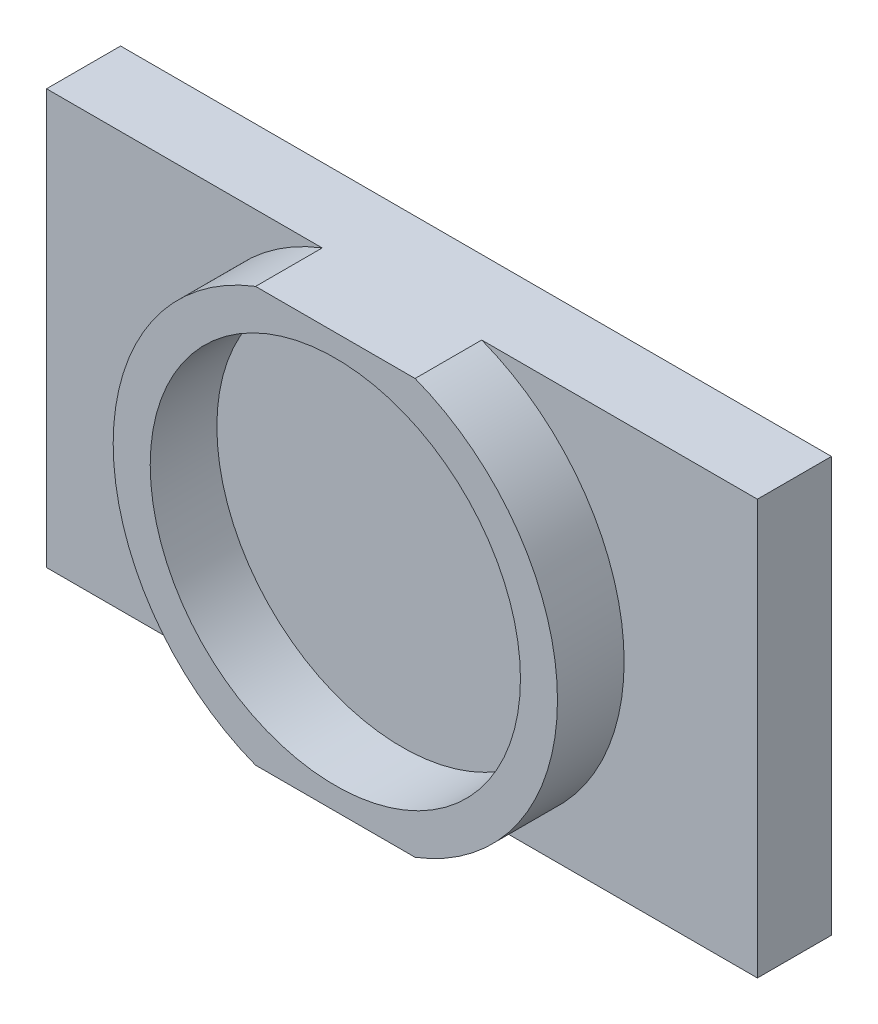
ISO-10303-21;
HEADER;
FILE_DESCRIPTION(('STEP AP214'),'2;1');
FILE_NAME('part.step','',(''),(''),'','','');
FILE_SCHEMA(('AUTOMOTIVE_DESIGN { 1 0 10303 214 1 1 1 1 }'));
ENDSEC;
DATA;
#1=APPLICATION_CONTEXT('core data for automotive mechanical design processes');
#2=APPLICATION_PROTOCOL_DEFINITION('international standard','automotive_design',2000,#1);
#3=PRODUCT_CONTEXT('',#1,'mechanical');
#4=PRODUCT('Part','Part','',(#3));
#5=PRODUCT_RELATED_PRODUCT_CATEGORY('part','',(#4));
#6=PRODUCT_DEFINITION_FORMATION('','',#4);
#7=PRODUCT_DEFINITION_CONTEXT('part definition',#1,'design');
#8=PRODUCT_DEFINITION('design','',#6,#7);
#9=PRODUCT_DEFINITION_SHAPE('','',#8);
#10=(LENGTH_UNIT() NAMED_UNIT(*) SI_UNIT(.MILLI.,.METRE.));
#11=(NAMED_UNIT(*) PLANE_ANGLE_UNIT() SI_UNIT($,.RADIAN.));
#12=(NAMED_UNIT(*) SI_UNIT($,.STERADIAN.) SOLID_ANGLE_UNIT());
#13=UNCERTAINTY_MEASURE_WITH_UNIT(LENGTH_MEASURE(1.E-05),#10,'distance_accuracy_value','');
#14=(GEOMETRIC_REPRESENTATION_CONTEXT(3) GLOBAL_UNCERTAINTY_ASSIGNED_CONTEXT((#13)) GLOBAL_UNIT_ASSIGNED_CONTEXT((#10,
#11,#12)) REPRESENTATION_CONTEXT('',''));
#15=CARTESIAN_POINT('',(0.,0.,0.));
#16=DIRECTION('',(0.,0.,1.));
#17=DIRECTION('',(1.,0.,0.));
#18=AXIS2_PLACEMENT_3D('',#15,#16,#17);
#19=CARTESIAN_POINT('',(0.,0.,0.));
#20=DIRECTION('',(0.,0.,1.));
#21=DIRECTION('',(1.,0.,0.));
#22=AXIS2_PLACEMENT_3D('',#19,#20,#21);
#23=PLANE('',#22);
#24=CARTESIAN_POINT('',(0.,0.,0.));
#25=DIRECTION('',(0.,0.,1.));
#26=DIRECTION('',(1.,0.,0.));
#27=AXIS2_PLACEMENT_3D('',#24,#25,#26);
#28=CIRCLE('',#27,38.1);
#29=CARTESIAN_POINT('',(-13.6783186101217,35.56,0.));
#30=VERTEX_POINT('',#29);
#31=CARTESIAN_POINT('',(-13.6783186101217,-35.56,0.));
#32=VERTEX_POINT('',#31);
#33=EDGE_CURVE('E50',#30,#32,#28,.T.);
#34=ORIENTED_EDGE('',*,*,#33,.F.);
#35=DIRECTION('',(-1.,0.,0.));
#36=VECTOR('',#35,1.);
#37=CARTESIAN_POINT('',(-60.96,35.56,0.));
#38=LINE('',#37,#36);
#39=CARTESIAN_POINT('',(-60.96,35.56,0.));
#40=VERTEX_POINT('',#39);
#41=EDGE_CURVE('E146',#30,#40,#38,.T.);
#42=ORIENTED_EDGE('',*,*,#41,.T.);
#43=DIRECTION('',(0.,-1.,0.));
#44=VECTOR('',#43,1.);
#45=CARTESIAN_POINT('',(-60.96,-35.56,0.));
#46=LINE('',#45,#44);
#47=CARTESIAN_POINT('',(-60.96,-35.56,0.));
#48=VERTEX_POINT('',#47);
#49=EDGE_CURVE('E215',#40,#48,#46,.T.);
#50=ORIENTED_EDGE('',*,*,#49,.T.);
#51=DIRECTION('',(1.,0.,0.));
#52=VECTOR('',#51,1.);
#53=CARTESIAN_POINT('',(-60.96,-35.56,0.));
#54=LINE('',#53,#52);
#55=EDGE_CURVE('E123',#48,#32,#54,.T.);
#56=ORIENTED_EDGE('',*,*,#55,.T.);
#57=EDGE_LOOP('',(#34,#42,#50,#56));
#58=FACE_BOUND('',#57,.T.);
#59=ADVANCED_FACE('F33',(#58),#23,.T.);
#60=CARTESIAN_POINT('',(-60.96,-35.56,-12.7));
#61=DIRECTION('',(0.,-1.,0.));
#62=DIRECTION('',(0.,0.,-1.));
#63=AXIS2_PLACEMENT_3D('',#60,#61,#62);
#64=PLANE('',#63);
#65=ORIENTED_EDGE('',*,*,#55,.F.);
#66=DIRECTION('',(0.,0.,1.));
#67=VECTOR('',#66,1.);
#68=CARTESIAN_POINT('',(-60.96,-35.56,-12.7));
#69=LINE('',#68,#67);
#70=CARTESIAN_POINT('',(-60.96,-35.56,-12.7));
#71=VERTEX_POINT('',#70);
#72=EDGE_CURVE('E11',#71,#48,#69,.T.);
#73=ORIENTED_EDGE('',*,*,#72,.F.);
#74=DIRECTION('',(1.,0.,0.));
#75=VECTOR('',#74,1.);
#76=CARTESIAN_POINT('',(-60.96,-35.56,-12.7));
#77=LINE('',#76,#75);
#78=CARTESIAN_POINT('',(60.96,-35.56,-12.7));
#79=VERTEX_POINT('',#78);
#80=EDGE_CURVE('E141',#71,#79,#77,.T.);
#81=ORIENTED_EDGE('',*,*,#80,.T.);
#82=DIRECTION('',(0.,0.,1.));
#83=VECTOR('',#82,1.);
#84=CARTESIAN_POINT('',(60.96,-35.56,-12.7));
#85=LINE('',#84,#83);
#86=CARTESIAN_POINT('',(60.96,-35.56,0.));
#87=VERTEX_POINT('',#86);
#88=EDGE_CURVE('E220',#79,#87,#85,.T.);
#89=ORIENTED_EDGE('',*,*,#88,.T.);
#90=CARTESIAN_POINT('',(13.6783186101217,-35.56,0.));
#91=VERTEX_POINT('',#90);
#92=EDGE_CURVE('E121',#91,#87,#54,.T.);
#93=ORIENTED_EDGE('',*,*,#92,.F.);
#94=DIRECTION('',(0.,0.,-1.));
#95=VECTOR('',#94,1.);
#96=CARTESIAN_POINT('',(13.6783186101217,-35.56,11.43));
#97=LINE('',#96,#95);
#98=CARTESIAN_POINT('',(13.6783186101217,-35.56,11.43));
#99=VERTEX_POINT('',#98);
#100=EDGE_CURVE('E105',#99,#91,#97,.T.);
#101=ORIENTED_EDGE('',*,*,#100,.F.);
#102=DIRECTION('',(1.,0.,0.));
#103=VECTOR('',#102,1.);
#104=CARTESIAN_POINT('',(-13.6783186101217,-35.56,11.43));
#105=LINE('',#104,#103);
#106=CARTESIAN_POINT('',(-13.6783186101217,-35.56,11.43));
#107=VERTEX_POINT('',#106);
#108=EDGE_CURVE('E99',#107,#99,#105,.T.);
#109=ORIENTED_EDGE('',*,*,#108,.F.);
#110=DIRECTION('',(0.,0.,-1.));
#111=VECTOR('',#110,1.);
#112=CARTESIAN_POINT('',(-13.6783186101217,-35.56,11.43));
#113=LINE('',#112,#111);
#114=EDGE_CURVE('E103',#107,#32,#113,.T.);
#115=ORIENTED_EDGE('',*,*,#114,.T.);
#116=EDGE_LOOP('',(#65,#73,#81,#89,#93,#101,#109,#115));
#117=FACE_BOUND('',#116,.T.);
#118=ADVANCED_FACE('F35',(#117),#64,.T.);
#119=CARTESIAN_POINT('',(-60.96,-35.56,-12.7));
#120=DIRECTION('',(-1.,0.,0.));
#121=DIRECTION('',(0.,0.,1.));
#122=AXIS2_PLACEMENT_3D('',#119,#120,#121);
#123=PLANE('',#122);
#124=ORIENTED_EDGE('',*,*,#49,.F.);
#125=DIRECTION('',(0.,0.,1.));
#126=VECTOR('',#125,1.);
#127=CARTESIAN_POINT('',(-60.96,35.56,-12.7));
#128=LINE('',#127,#126);
#129=CARTESIAN_POINT('',(-60.96,35.56,-12.7));
#130=VERTEX_POINT('',#129);
#131=EDGE_CURVE('E42',#130,#40,#128,.T.);
#132=ORIENTED_EDGE('',*,*,#131,.F.);
#133=DIRECTION('',(0.,-1.,0.));
#134=VECTOR('',#133,1.);
#135=CARTESIAN_POINT('',(-60.96,-35.56,-12.7));
#136=LINE('',#135,#134);
#137=EDGE_CURVE('E211',#130,#71,#136,.T.);
#138=ORIENTED_EDGE('',*,*,#137,.T.);
#139=ORIENTED_EDGE('',*,*,#72,.T.);
#140=EDGE_LOOP('',(#124,#132,#138,#139));
#141=FACE_BOUND('',#140,.T.);
#142=ADVANCED_FACE('F182',(#141),#123,.T.);
#143=CARTESIAN_POINT('',(-60.96,35.56,-12.7));
#144=DIRECTION('',(0.,1.,0.));
#145=DIRECTION('',(0.,0.,1.));
#146=AXIS2_PLACEMENT_3D('',#143,#144,#145);
#147=PLANE('',#146);
#148=CARTESIAN_POINT('',(60.96,35.56,0.));
#149=VERTEX_POINT('',#148);
#150=CARTESIAN_POINT('',(13.6783186101217,35.56,0.));
#151=VERTEX_POINT('',#150);
#152=EDGE_CURVE('E236',#149,#151,#38,.T.);
#153=ORIENTED_EDGE('',*,*,#152,.F.);
#154=DIRECTION('',(0.,0.,1.));
#155=VECTOR('',#154,1.);
#156=CARTESIAN_POINT('',(60.96,35.56,-12.7));
#157=LINE('',#156,#155);
#158=CARTESIAN_POINT('',(60.96,35.56,-12.7));
#159=VERTEX_POINT('',#158);
#160=EDGE_CURVE('E223',#159,#149,#157,.T.);
#161=ORIENTED_EDGE('',*,*,#160,.F.);
#162=DIRECTION('',(-1.,0.,0.));
#163=VECTOR('',#162,1.);
#164=CARTESIAN_POINT('',(-60.96,35.56,-12.7));
#165=LINE('',#164,#163);
#166=EDGE_CURVE('E221',#159,#130,#165,.T.);
#167=ORIENTED_EDGE('',*,*,#166,.T.);
#168=ORIENTED_EDGE('',*,*,#131,.T.);
#169=ORIENTED_EDGE('',*,*,#41,.F.);
#170=DIRECTION('',(0.,0.,-1.));
#171=VECTOR('',#170,1.);
#172=CARTESIAN_POINT('',(-13.6783186101216,35.56,11.43));
#173=LINE('',#172,#171);
#174=CARTESIAN_POINT('',(-13.6783186101216,35.56,11.43));
#175=VERTEX_POINT('',#174);
#176=EDGE_CURVE('E134',#175,#30,#173,.T.);
#177=ORIENTED_EDGE('',*,*,#176,.F.);
#178=DIRECTION('',(-1.,0.,0.));
#179=VECTOR('',#178,1.);
#180=CARTESIAN_POINT('',(-13.6783186101216,35.56,11.43));
#181=LINE('',#180,#179);
#182=CARTESIAN_POINT('',(13.6783186101217,35.56,11.43));
#183=VERTEX_POINT('',#182);
#184=EDGE_CURVE('E115',#183,#175,#181,.T.);
#185=ORIENTED_EDGE('',*,*,#184,.F.);
#186=DIRECTION('',(0.,0.,-1.));
#187=VECTOR('',#186,1.);
#188=CARTESIAN_POINT('',(13.6783186101217,35.56,11.43));
#189=LINE('',#188,#187);
#190=EDGE_CURVE('E125',#183,#151,#189,.T.);
#191=ORIENTED_EDGE('',*,*,#190,.T.);
#192=EDGE_LOOP('',(#153,#161,#167,#168,#169,#177,#185,#191));
#193=FACE_BOUND('',#192,.T.);
#194=ADVANCED_FACE('F203',(#193),#147,.T.);
#195=CARTESIAN_POINT('',(60.96,-35.56,-12.7));
#196=DIRECTION('',(1.,0.,0.));
#197=DIRECTION('',(0.,0.,-1.));
#198=AXIS2_PLACEMENT_3D('',#195,#196,#197);
#199=PLANE('',#198);
#200=DIRECTION('',(0.,1.,0.));
#201=VECTOR('',#200,1.);
#202=CARTESIAN_POINT('',(60.96,-35.56,0.));
#203=LINE('',#202,#201);
#204=EDGE_CURVE('E229',#87,#149,#203,.T.);
#205=ORIENTED_EDGE('',*,*,#204,.F.);
#206=ORIENTED_EDGE('',*,*,#88,.F.);
#207=DIRECTION('',(0.,1.,0.));
#208=VECTOR('',#207,1.);
#209=CARTESIAN_POINT('',(60.96,-35.56,-12.7));
#210=LINE('',#209,#208);
#211=EDGE_CURVE('E213',#79,#159,#210,.T.);
#212=ORIENTED_EDGE('',*,*,#211,.T.);
#213=ORIENTED_EDGE('',*,*,#160,.T.);
#214=EDGE_LOOP('',(#205,#206,#212,#213));
#215=FACE_BOUND('',#214,.T.);
#216=ADVANCED_FACE('F198',(#215),#199,.T.);
#217=CARTESIAN_POINT('',(0.,0.,-12.7));
#218=DIRECTION('',(0.,0.,1.));
#219=DIRECTION('',(1.,0.,0.));
#220=AXIS2_PLACEMENT_3D('',#217,#218,#219);
#221=PLANE('',#220);
#222=ORIENTED_EDGE('',*,*,#80,.F.);
#223=ORIENTED_EDGE('',*,*,#137,.F.);
#224=ORIENTED_EDGE('',*,*,#166,.F.);
#225=ORIENTED_EDGE('',*,*,#211,.F.);
#226=EDGE_LOOP('',(#222,#223,#224,#225));
#227=FACE_BOUND('',#226,.T.);
#228=ADVANCED_FACE('F173',(#227),#221,.F.);
#229=CARTESIAN_POINT('',(0.,0.,0.));
#230=DIRECTION('',(0.,0.,1.));
#231=DIRECTION('',(1.,0.,0.));
#232=AXIS2_PLACEMENT_3D('',#229,#230,#231);
#233=CIRCLE('',#232,38.1);
#234=EDGE_CURVE('E58',#91,#151,#233,.T.);
#235=ORIENTED_EDGE('',*,*,#234,.F.);
#236=ORIENTED_EDGE('',*,*,#92,.T.);
#237=ORIENTED_EDGE('',*,*,#204,.T.);
#238=ORIENTED_EDGE('',*,*,#152,.T.);
#239=EDGE_LOOP('',(#235,#236,#237,#238));
#240=FACE_BOUND('',#239,.T.);
#241=ADVANCED_FACE('F165',(#240),#23,.T.);
#242=CARTESIAN_POINT('',(0.,0.,11.43));
#243=DIRECTION('',(0.,0.,1.));
#244=DIRECTION('',(1.,0.,0.));
#245=AXIS2_PLACEMENT_3D('',#242,#243,#244);
#246=PLANE('',#245);
#247=CARTESIAN_POINT('',(0.,0.,11.43));
#248=DIRECTION('',(0.,0.,1.));
#249=DIRECTION('',(1.,0.,0.));
#250=AXIS2_PLACEMENT_3D('',#247,#248,#249);
#251=CIRCLE('',#250,38.1);
#252=EDGE_CURVE('E109',#175,#107,#251,.T.);
#253=ORIENTED_EDGE('',*,*,#252,.T.);
#254=ORIENTED_EDGE('',*,*,#108,.T.);
#255=CARTESIAN_POINT('',(0.,0.,11.43));
#256=DIRECTION('',(0.,0.,1.));
#257=DIRECTION('',(1.,0.,0.));
#258=AXIS2_PLACEMENT_3D('',#255,#256,#257);
#259=CIRCLE('',#258,38.1);
#260=EDGE_CURVE('E108',#99,#183,#259,.T.);
#261=ORIENTED_EDGE('',*,*,#260,.T.);
#262=ORIENTED_EDGE('',*,*,#184,.T.);
#263=EDGE_LOOP('',(#253,#254,#261,#262));
#264=FACE_BOUND('',#263,.T.);
#265=CARTESIAN_POINT('',(0.,0.,11.43));
#266=DIRECTION('',(0.,0.,1.));
#267=DIRECTION('',(1.,0.,0.));
#268=AXIS2_PLACEMENT_3D('',#265,#266,#267);
#269=CIRCLE('',#268,31.75);
#270=CARTESIAN_POINT('',(31.75,0.,11.43));
#271=VERTEX_POINT('',#270);
#272=EDGE_CURVE('E133',#271,#271,#269,.T.);
#273=ORIENTED_EDGE('',*,*,#272,.F.);
#274=EDGE_LOOP('',(#273));
#275=FACE_BOUND('',#274,.T.);
#276=ADVANCED_FACE('F112',(#264,#275),#246,.T.);
#277=CARTESIAN_POINT('',(0.,0.,11.43));
#278=DIRECTION('',(0.,0.,-1.));
#279=DIRECTION('',(-1.,0.,0.));
#280=AXIS2_PLACEMENT_3D('',#277,#278,#279);
#281=CYLINDRICAL_SURFACE('',#280,38.1);
#282=ORIENTED_EDGE('',*,*,#33,.T.);
#283=ORIENTED_EDGE('',*,*,#114,.F.);
#284=ORIENTED_EDGE('',*,*,#252,.F.);
#285=ORIENTED_EDGE('',*,*,#176,.T.);
#286=EDGE_LOOP('',(#282,#283,#284,#285));
#287=FACE_BOUND('',#286,.T.);
#288=ADVANCED_FACE('F120',(#287),#281,.T.);
#289=CARTESIAN_POINT('',(0.,0.,11.43));
#290=DIRECTION('',(0.,0.,-1.));
#291=DIRECTION('',(-1.,0.,0.));
#292=AXIS2_PLACEMENT_3D('',#289,#290,#291);
#293=CYLINDRICAL_SURFACE('',#292,38.1);
#294=ORIENTED_EDGE('',*,*,#234,.T.);
#295=ORIENTED_EDGE('',*,*,#190,.F.);
#296=ORIENTED_EDGE('',*,*,#260,.F.);
#297=ORIENTED_EDGE('',*,*,#100,.T.);
#298=EDGE_LOOP('',(#294,#295,#296,#297));
#299=FACE_BOUND('',#298,.T.);
#300=ADVANCED_FACE('F171',(#299),#293,.T.);
#301=CARTESIAN_POINT('',(0.,0.,11.43));
#302=DIRECTION('',(0.,0.,-1.));
#303=DIRECTION('',(-1.,0.,0.));
#304=AXIS2_PLACEMENT_3D('',#301,#302,#303);
#305=CYLINDRICAL_SURFACE('',#304,31.75);
#306=ORIENTED_EDGE('',*,*,#272,.T.);
#307=EDGE_LOOP('',(#306));
#308=FACE_BOUND('',#307,.T.);
#309=CARTESIAN_POINT('',(0.,0.,0.));
#310=DIRECTION('',(0.,0.,1.));
#311=DIRECTION('',(1.,0.,0.));
#312=AXIS2_PLACEMENT_3D('',#309,#310,#311);
#313=CIRCLE('',#312,31.75);
#314=CARTESIAN_POINT('',(31.75,0.,0.));
#315=VERTEX_POINT('',#314);
#316=EDGE_CURVE('E156',#315,#315,#313,.T.);
#317=ORIENTED_EDGE('',*,*,#316,.F.);
#318=EDGE_LOOP('',(#317));
#319=FACE_BOUND('',#318,.T.);
#320=ADVANCED_FACE('F162',(#308,#319),#305,.F.);
#321=ORIENTED_EDGE('',*,*,#316,.T.);
#322=EDGE_LOOP('',(#321));
#323=FACE_BOUND('',#322,.T.);
#324=ADVANCED_FACE('F175',(#323),#23,.T.);
#325=CLOSED_SHELL('',(#59,#118,#142,#194,#216,#228,#241,#276,#288,#300,#320,#324));
#326=MANIFOLD_SOLID_BREP('B2',#325);
#327=ADVANCED_BREP_SHAPE_REPRESENTATION('',(#18,#326),#14);
#328=SHAPE_DEFINITION_REPRESENTATION(#9,#327);
ENDSEC;
END-ISO-10303-21;
